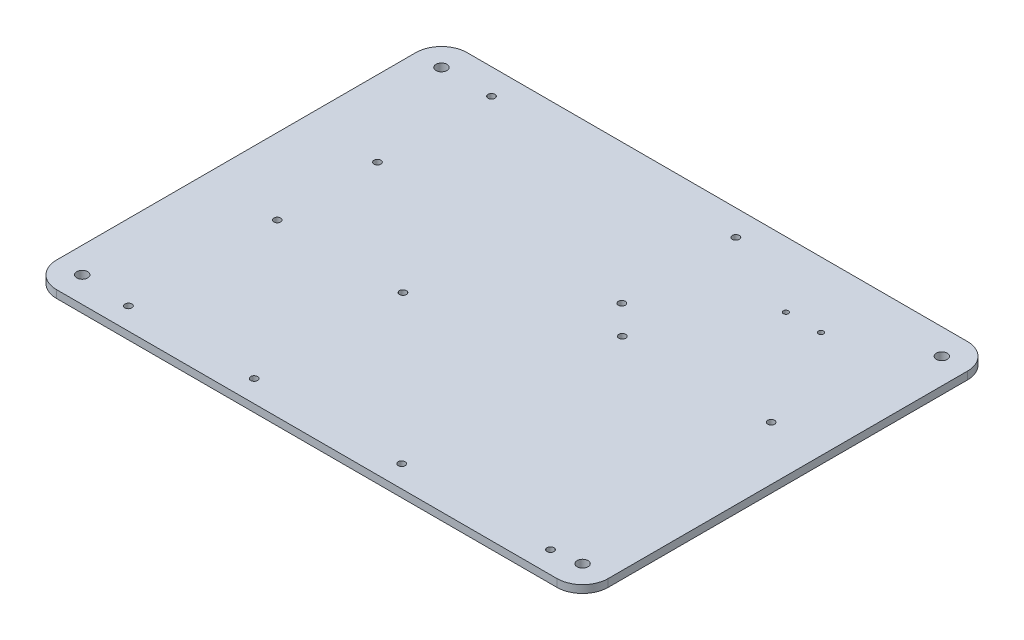
ISO-10303-21;
HEADER;
FILE_DESCRIPTION(('STEP AP214'),'2;1');
FILE_NAME('part.step','',(''),(''),'','','');
FILE_SCHEMA(('AUTOMOTIVE_DESIGN { 1 0 10303 214 1 1 1 1 }'));
ENDSEC;
DATA;
#1=APPLICATION_CONTEXT('core data for automotive mechanical design processes');
#2=APPLICATION_PROTOCOL_DEFINITION('international standard','automotive_design',2000,#1);
#3=PRODUCT_CONTEXT('',#1,'mechanical');
#4=PRODUCT('Part','Part','',(#3));
#5=PRODUCT_RELATED_PRODUCT_CATEGORY('part','',(#4));
#6=PRODUCT_DEFINITION_FORMATION('','',#4);
#7=PRODUCT_DEFINITION_CONTEXT('part definition',#1,'design');
#8=PRODUCT_DEFINITION('design','',#6,#7);
#9=PRODUCT_DEFINITION_SHAPE('','',#8);
#10=(LENGTH_UNIT() NAMED_UNIT(*) SI_UNIT(.MILLI.,.METRE.));
#11=(NAMED_UNIT(*) PLANE_ANGLE_UNIT() SI_UNIT($,.RADIAN.));
#12=(NAMED_UNIT(*) SI_UNIT($,.STERADIAN.) SOLID_ANGLE_UNIT());
#13=UNCERTAINTY_MEASURE_WITH_UNIT(LENGTH_MEASURE(1.E-05),#10,'distance_accuracy_value','');
#14=(GEOMETRIC_REPRESENTATION_CONTEXT(3) GLOBAL_UNCERTAINTY_ASSIGNED_CONTEXT((#13)) GLOBAL_UNIT_ASSIGNED_CONTEXT((#10,
#11,#12)) REPRESENTATION_CONTEXT('',''));
#15=CARTESIAN_POINT('',(0.,0.,0.));
#16=DIRECTION('',(0.,0.,1.));
#17=DIRECTION('',(1.,0.,0.));
#18=AXIS2_PLACEMENT_3D('',#15,#16,#17);
#19=CARTESIAN_POINT('',(-107.5,213.,-80.));
#20=DIRECTION('',(1.,0.,0.));
#21=DIRECTION('',(0.,1.,0.));
#22=AXIS2_PLACEMENT_3D('',#19,#20,#21);
#23=PLANE('',#22);
#24=DIRECTION('',(0.,0.,1.));
#25=VECTOR('',#24,1.);
#26=CARTESIAN_POINT('',(-107.5,210.,-80.));
#27=LINE('',#26,#25);
#28=CARTESIAN_POINT('',(-107.5,210.,-70.));
#29=VERTEX_POINT('',#28);
#30=CARTESIAN_POINT('',(-107.5,210.,70.));
#31=VERTEX_POINT('',#30);
#32=EDGE_CURVE('E130',#29,#31,#27,.T.);
#33=ORIENTED_EDGE('',*,*,#32,.T.);
#34=DIRECTION('',(0.,-1.,0.));
#35=VECTOR('',#34,1.);
#36=CARTESIAN_POINT('',(-107.5,213.,70.));
#37=LINE('',#36,#35);
#38=CARTESIAN_POINT('',(-107.5,213.,70.));
#39=VERTEX_POINT('',#38);
#40=EDGE_CURVE('E108',#31,#39,#37,.F.);
#41=ORIENTED_EDGE('',*,*,#40,.T.);
#42=DIRECTION('',(0.,0.,1.));
#43=VECTOR('',#42,1.);
#44=CARTESIAN_POINT('',(-107.5,213.,-80.));
#45=LINE('',#44,#43);
#46=CARTESIAN_POINT('',(-107.5,213.,-70.));
#47=VERTEX_POINT('',#46);
#48=EDGE_CURVE('E140',#47,#39,#45,.T.);
#49=ORIENTED_EDGE('',*,*,#48,.F.);
#50=DIRECTION('',(0.,-1.,0.));
#51=VECTOR('',#50,1.);
#52=CARTESIAN_POINT('',(-107.5,213.,-70.));
#53=LINE('',#52,#51);
#54=EDGE_CURVE('E113',#47,#29,#53,.T.);
#55=ORIENTED_EDGE('',*,*,#54,.T.);
#56=EDGE_LOOP('',(#33,#41,#49,#55));
#57=FACE_BOUND('',#56,.T.);
#58=ADVANCED_FACE('F37',(#57),#23,.F.);
#59=CARTESIAN_POINT('',(-107.5,213.,80.));
#60=DIRECTION('',(0.,0.,-1.));
#61=DIRECTION('',(0.,1.,0.));
#62=AXIS2_PLACEMENT_3D('',#59,#60,#61);
#63=PLANE('',#62);
#64=DIRECTION('',(1.,0.,0.));
#65=VECTOR('',#64,1.);
#66=CARTESIAN_POINT('',(-107.5,213.,80.));
#67=LINE('',#66,#65);
#68=CARTESIAN_POINT('',(-97.5,213.,80.));
#69=VERTEX_POINT('',#68);
#70=CARTESIAN_POINT('',(97.5,212.999999999998,80.));
#71=VERTEX_POINT('',#70);
#72=EDGE_CURVE('E123',#69,#71,#67,.T.);
#73=ORIENTED_EDGE('',*,*,#72,.F.);
#74=DIRECTION('',(0.,-1.,0.));
#75=VECTOR('',#74,1.);
#76=CARTESIAN_POINT('',(-97.5,213.,80.));
#77=LINE('',#76,#75);
#78=CARTESIAN_POINT('',(-97.5,210.,80.));
#79=VERTEX_POINT('',#78);
#80=EDGE_CURVE('E107',#69,#79,#77,.T.);
#81=ORIENTED_EDGE('',*,*,#80,.T.);
#82=DIRECTION('',(1.,0.,0.));
#83=VECTOR('',#82,1.);
#84=CARTESIAN_POINT('',(-107.5,210.,80.));
#85=LINE('',#84,#83);
#86=CARTESIAN_POINT('',(97.5,209.999999999998,80.));
#87=VERTEX_POINT('',#86);
#88=EDGE_CURVE('E120',#79,#87,#85,.T.);
#89=ORIENTED_EDGE('',*,*,#88,.T.);
#90=DIRECTION('',(0.,-1.,0.));
#91=VECTOR('',#90,1.);
#92=CARTESIAN_POINT('',(97.5,212.999999999998,80.));
#93=LINE('',#92,#91);
#94=EDGE_CURVE('E125',#87,#71,#93,.F.);
#95=ORIENTED_EDGE('',*,*,#94,.T.);
#96=EDGE_LOOP('',(#73,#81,#89,#95));
#97=FACE_BOUND('',#96,.T.);
#98=ADVANCED_FACE('F119',(#97),#63,.F.);
#99=CARTESIAN_POINT('',(107.5,212.999999999998,-80.));
#100=DIRECTION('',(-1.,0.,0.));
#101=DIRECTION('',(0.,-1.,0.));
#102=AXIS2_PLACEMENT_3D('',#99,#100,#101);
#103=PLANE('',#102);
#104=DIRECTION('',(0.,0.,-1.));
#105=VECTOR('',#104,1.);
#106=CARTESIAN_POINT('',(107.5,212.999999999998,-80.));
#107=LINE('',#106,#105);
#108=CARTESIAN_POINT('',(107.5,212.999999999998,70.));
#109=VERTEX_POINT('',#108);
#110=CARTESIAN_POINT('',(107.5,212.999999999998,-70.));
#111=VERTEX_POINT('',#110);
#112=EDGE_CURVE('E166',#109,#111,#107,.T.);
#113=ORIENTED_EDGE('',*,*,#112,.F.);
#114=DIRECTION('',(0.,-1.,0.));
#115=VECTOR('',#114,1.);
#116=CARTESIAN_POINT('',(107.5,212.999999999998,70.));
#117=LINE('',#116,#115);
#118=CARTESIAN_POINT('',(107.5,209.999999999998,70.));
#119=VERTEX_POINT('',#118);
#120=EDGE_CURVE('E159',#109,#119,#117,.T.);
#121=ORIENTED_EDGE('',*,*,#120,.T.);
#122=DIRECTION('',(0.,0.,-1.));
#123=VECTOR('',#122,1.);
#124=CARTESIAN_POINT('',(107.5,209.999999999998,-80.));
#125=LINE('',#124,#123);
#126=CARTESIAN_POINT('',(107.5,209.999999999998,-70.));
#127=VERTEX_POINT('',#126);
#128=EDGE_CURVE('E129',#119,#127,#125,.T.);
#129=ORIENTED_EDGE('',*,*,#128,.T.);
#130=DIRECTION('',(0.,-1.,0.));
#131=VECTOR('',#130,1.);
#132=CARTESIAN_POINT('',(107.5,212.999999999998,-70.));
#133=LINE('',#132,#131);
#134=EDGE_CURVE('E157',#127,#111,#133,.F.);
#135=ORIENTED_EDGE('',*,*,#134,.T.);
#136=EDGE_LOOP('',(#113,#121,#129,#135));
#137=FACE_BOUND('',#136,.T.);
#138=ADVANCED_FACE('F164',(#137),#103,.F.);
#139=CARTESIAN_POINT('',(-107.5,213.,-80.));
#140=DIRECTION('',(0.,0.,1.));
#141=DIRECTION('',(0.,-1.,0.));
#142=AXIS2_PLACEMENT_3D('',#139,#140,#141);
#143=PLANE('',#142);
#144=DIRECTION('',(-1.,0.,0.));
#145=VECTOR('',#144,1.);
#146=CARTESIAN_POINT('',(-107.5,213.,-80.));
#147=LINE('',#146,#145);
#148=CARTESIAN_POINT('',(97.5,212.999999999998,-80.));
#149=VERTEX_POINT('',#148);
#150=CARTESIAN_POINT('',(-97.5,213.,-80.));
#151=VERTEX_POINT('',#150);
#152=EDGE_CURVE('E141',#149,#151,#147,.T.);
#153=ORIENTED_EDGE('',*,*,#152,.F.);
#154=DIRECTION('',(0.,-1.,0.));
#155=VECTOR('',#154,1.);
#156=CARTESIAN_POINT('',(97.5,212.999999999998,-80.));
#157=LINE('',#156,#155);
#158=CARTESIAN_POINT('',(97.5,209.999999999998,-80.));
#159=VERTEX_POINT('',#158);
#160=EDGE_CURVE('E11',#149,#159,#157,.T.);
#161=ORIENTED_EDGE('',*,*,#160,.T.);
#162=DIRECTION('',(-1.,0.,0.));
#163=VECTOR('',#162,1.);
#164=CARTESIAN_POINT('',(-107.5,210.,-80.));
#165=LINE('',#164,#163);
#166=CARTESIAN_POINT('',(-97.5,210.,-80.));
#167=VERTEX_POINT('',#166);
#168=EDGE_CURVE('E133',#159,#167,#165,.T.);
#169=ORIENTED_EDGE('',*,*,#168,.T.);
#170=DIRECTION('',(0.,-1.,0.));
#171=VECTOR('',#170,1.);
#172=CARTESIAN_POINT('',(-97.5,213.,-80.));
#173=LINE('',#172,#171);
#174=EDGE_CURVE('E45',#167,#151,#173,.F.);
#175=ORIENTED_EDGE('',*,*,#174,.T.);
#176=EDGE_LOOP('',(#153,#161,#169,#175));
#177=FACE_BOUND('',#176,.T.);
#178=ADVANCED_FACE('F173',(#177),#143,.F.);
#179=CARTESIAN_POINT('',(2.19985138049827E-12,212.999999999999,0.));
#180=DIRECTION('',(0.,1.,0.));
#181=DIRECTION('',(-1.,0.,0.));
#182=AXIS2_PLACEMENT_3D('',#179,#180,#181);
#183=PLANE('',#182);
#184=CARTESIAN_POINT('',(-78.,213.,-25.55));
#185=DIRECTION('',(0.,1.,0.));
#186=DIRECTION('',(-1.,0.,0.));
#187=AXIS2_PLACEMENT_3D('',#184,#185,#186);
#188=CIRCLE('',#187,1.35000000000001);
#189=CARTESIAN_POINT('',(-79.35,213.,-25.55));
#190=VERTEX_POINT('',#189);
#191=EDGE_CURVE('E253',#190,#190,#188,.T.);
#192=ORIENTED_EDGE('',*,*,#191,.F.);
#193=EDGE_LOOP('',(#192));
#194=FACE_BOUND('',#193,.T.);
#195=CARTESIAN_POINT('',(17.25,212.999999999999,-25.55));
#196=DIRECTION('',(0.,1.,0.));
#197=DIRECTION('',(-1.,0.,0.));
#198=AXIS2_PLACEMENT_3D('',#195,#196,#197);
#199=CIRCLE('',#198,1.35);
#200=CARTESIAN_POINT('',(15.9,212.999999999999,-25.55));
#201=VERTEX_POINT('',#200);
#202=EDGE_CURVE('E247',#201,#201,#199,.T.);
#203=ORIENTED_EDGE('',*,*,#202,.F.);
#204=EDGE_LOOP('',(#203));
#205=FACE_BOUND('',#204,.T.);
#206=CARTESIAN_POINT('',(17.25,212.999999999999,-70.));
#207=DIRECTION('',(0.,1.,0.));
#208=DIRECTION('',(-1.,0.,0.));
#209=AXIS2_PLACEMENT_3D('',#206,#207,#208);
#210=CIRCLE('',#209,1.34999999999997);
#211=CARTESIAN_POINT('',(15.9,212.999999999999,-70.));
#212=VERTEX_POINT('',#211);
#213=EDGE_CURVE('E241',#212,#212,#210,.T.);
#214=ORIENTED_EDGE('',*,*,#213,.F.);
#215=EDGE_LOOP('',(#214));
#216=FACE_BOUND('',#215,.T.);
#217=CARTESIAN_POINT('',(52.25,212.999999999998,-54.5));
#218=DIRECTION('',(0.,1.,0.));
#219=DIRECTION('',(-1.,0.,0.));
#220=AXIS2_PLACEMENT_3D('',#217,#218,#219);
#221=CIRCLE('',#220,0.999999999999998);
#222=CARTESIAN_POINT('',(51.25,212.999999999998,-54.5));
#223=VERTEX_POINT('',#222);
#224=EDGE_CURVE('E234',#223,#223,#221,.T.);
#225=ORIENTED_EDGE('',*,*,#224,.F.);
#226=EDGE_LOOP('',(#225));
#227=FACE_BOUND('',#226,.T.);
#228=CARTESIAN_POINT('',(65.95,212.999999999998,-54.5));
#229=DIRECTION('',(0.,1.,0.));
#230=DIRECTION('',(-1.,0.,0.));
#231=AXIS2_PLACEMENT_3D('',#228,#229,#230);
#232=CIRCLE('',#231,0.999999999999998);
#233=CARTESIAN_POINT('',(64.95,212.999999999998,-54.5));
#234=VERTEX_POINT('',#233);
#235=EDGE_CURVE('E277',#234,#234,#232,.T.);
#236=ORIENTED_EDGE('',*,*,#235,.F.);
#237=EDGE_LOOP('',(#236));
#238=FACE_BOUND('',#237,.T.);
#239=CARTESIAN_POINT('',(97.5000000000001,212.999999999998,70.));
#240=DIRECTION('',(0.,1.,0.));
#241=DIRECTION('',(-1.,0.,0.));
#242=AXIS2_PLACEMENT_3D('',#239,#240,#241);
#243=CIRCLE('',#242,2.125);
#244=CARTESIAN_POINT('',(95.3750000000001,212.999999999998,70.));
#245=VERTEX_POINT('',#244);
#246=EDGE_CURVE('E271',#245,#245,#243,.T.);
#247=ORIENTED_EDGE('',*,*,#246,.F.);
#248=EDGE_LOOP('',(#247));
#249=FACE_BOUND('',#248,.T.);
#250=CARTESIAN_POINT('',(97.5000000000001,212.999999999998,-70.));
#251=DIRECTION('',(0.,1.,0.));
#252=DIRECTION('',(-1.,0.,0.));
#253=AXIS2_PLACEMENT_3D('',#250,#251,#252);
#254=CIRCLE('',#253,2.125);
#255=CARTESIAN_POINT('',(95.3750000000001,212.999999999998,-70.));
#256=VERTEX_POINT('',#255);
#257=EDGE_CURVE('E265',#256,#256,#254,.T.);
#258=ORIENTED_EDGE('',*,*,#257,.F.);
#259=EDGE_LOOP('',(#258));
#260=FACE_BOUND('',#259,.T.);
#261=CARTESIAN_POINT('',(-97.5,213.,-70.));
#262=DIRECTION('',(0.,1.,0.));
#263=DIRECTION('',(-1.,0.,0.));
#264=AXIS2_PLACEMENT_3D('',#261,#262,#263);
#265=CIRCLE('',#264,2.125);
#266=CARTESIAN_POINT('',(-99.625,213.,-70.));
#267=VERTEX_POINT('',#266);
#268=EDGE_CURVE('E258',#267,#267,#265,.T.);
#269=ORIENTED_EDGE('',*,*,#268,.F.);
#270=EDGE_LOOP('',(#269));
#271=FACE_BOUND('',#270,.T.);
#272=CARTESIAN_POINT('',(-78.,213.,13.5));
#273=DIRECTION('',(0.,1.,0.));
#274=DIRECTION('',(-1.,0.,0.));
#275=AXIS2_PLACEMENT_3D('',#272,#273,#274);
#276=CIRCLE('',#275,1.35000000000001);
#277=CARTESIAN_POINT('',(-79.35,213.,13.5));
#278=VERTEX_POINT('',#277);
#279=EDGE_CURVE('E205',#278,#278,#276,.T.);
#280=ORIENTED_EDGE('',*,*,#279,.F.);
#281=EDGE_LOOP('',(#280));
#282=FACE_BOUND('',#281,.T.);
#283=CARTESIAN_POINT('',(-29.,212.999999999999,13.5));
#284=DIRECTION('',(0.,1.,0.));
#285=DIRECTION('',(-1.,0.,0.));
#286=AXIS2_PLACEMENT_3D('',#283,#284,#285);
#287=CIRCLE('',#286,1.35);
#288=CARTESIAN_POINT('',(-30.35,212.999999999999,13.5));
#289=VERTEX_POINT('',#288);
#290=EDGE_CURVE('E199',#289,#289,#287,.T.);
#291=ORIENTED_EDGE('',*,*,#290,.F.);
#292=EDGE_LOOP('',(#291));
#293=FACE_BOUND('',#292,.T.);
#294=CARTESIAN_POINT('',(-29.,212.999999999999,71.5));
#295=DIRECTION('',(0.,1.,0.));
#296=DIRECTION('',(-1.,0.,0.));
#297=AXIS2_PLACEMENT_3D('',#294,#295,#296);
#298=CIRCLE('',#297,1.35);
#299=CARTESIAN_POINT('',(-30.35,212.999999999999,71.5));
#300=VERTEX_POINT('',#299);
#301=EDGE_CURVE('E193',#300,#300,#298,.T.);
#302=ORIENTED_EDGE('',*,*,#301,.F.);
#303=EDGE_LOOP('',(#302));
#304=FACE_BOUND('',#303,.T.);
#305=CARTESIAN_POINT('',(-78.,213.,71.5));
#306=DIRECTION('',(0.,1.,0.));
#307=DIRECTION('',(-1.,0.,0.));
#308=AXIS2_PLACEMENT_3D('',#305,#306,#307);
#309=CIRCLE('',#308,1.35000000000001);
#310=CARTESIAN_POINT('',(-79.35,213.,71.5));
#311=VERTEX_POINT('',#310);
#312=EDGE_CURVE('E186',#311,#311,#309,.T.);
#313=ORIENTED_EDGE('',*,*,#312,.F.);
#314=EDGE_LOOP('',(#313));
#315=FACE_BOUND('',#314,.T.);
#316=CARTESIAN_POINT('',(-78.,213.,-70.));
#317=DIRECTION('',(0.,1.,0.));
#318=DIRECTION('',(-1.,0.,0.));
#319=AXIS2_PLACEMENT_3D('',#316,#317,#318);
#320=CIRCLE('',#319,1.35000000000001);
#321=CARTESIAN_POINT('',(-79.35,213.,-70.));
#322=VERTEX_POINT('',#321);
#323=EDGE_CURVE('E222',#322,#322,#320,.T.);
#324=ORIENTED_EDGE('',*,*,#323,.F.);
#325=EDGE_LOOP('',(#324));
#326=FACE_BOUND('',#325,.T.);
#327=CARTESIAN_POINT('',(28.5,212.999999999999,-14.5));
#328=DIRECTION('',(0.,1.,0.));
#329=DIRECTION('',(-1.,0.,0.));
#330=AXIS2_PLACEMENT_3D('',#327,#328,#329);
#331=CIRCLE('',#330,1.35);
#332=CARTESIAN_POINT('',(27.15,212.999999999999,-14.5));
#333=VERTEX_POINT('',#332);
#334=EDGE_CURVE('E229',#333,#333,#331,.T.);
#335=ORIENTED_EDGE('',*,*,#334,.F.);
#336=EDGE_LOOP('',(#335));
#337=FACE_BOUND('',#336,.T.);
#338=CARTESIAN_POINT('',(28.5,212.999999999999,71.5));
#339=DIRECTION('',(0.,1.,0.));
#340=DIRECTION('',(-1.,0.,0.));
#341=AXIS2_PLACEMENT_3D('',#338,#339,#340);
#342=CIRCLE('',#341,1.35);
#343=CARTESIAN_POINT('',(27.15,212.999999999999,71.5));
#344=VERTEX_POINT('',#343);
#345=EDGE_CURVE('E210',#344,#344,#342,.T.);
#346=ORIENTED_EDGE('',*,*,#345,.F.);
#347=EDGE_LOOP('',(#346));
#348=FACE_BOUND('',#347,.T.);
#349=CARTESIAN_POINT('',(86.5,212.999999999998,-14.5));
#350=DIRECTION('',(0.,1.,0.));
#351=DIRECTION('',(-1.,0.,0.));
#352=AXIS2_PLACEMENT_3D('',#349,#350,#351);
#353=CIRCLE('',#352,1.35000000000001);
#354=CARTESIAN_POINT('',(85.15,212.999999999998,-14.5));
#355=VERTEX_POINT('',#354);
#356=EDGE_CURVE('E217',#355,#355,#353,.T.);
#357=ORIENTED_EDGE('',*,*,#356,.F.);
#358=EDGE_LOOP('',(#357));
#359=FACE_BOUND('',#358,.T.);
#360=CARTESIAN_POINT('',(-97.5,213.,70.));
#361=DIRECTION('',(0.,1.,0.));
#362=DIRECTION('',(-1.,0.,0.));
#363=AXIS2_PLACEMENT_3D('',#360,#361,#362);
#364=CIRCLE('',#363,2.125);
#365=CARTESIAN_POINT('',(-99.625,213.,70.));
#366=VERTEX_POINT('',#365);
#367=EDGE_CURVE('E282',#366,#366,#364,.T.);
#368=ORIENTED_EDGE('',*,*,#367,.F.);
#369=EDGE_LOOP('',(#368));
#370=FACE_BOUND('',#369,.T.);
#371=CARTESIAN_POINT('',(86.5,212.999999999998,71.5));
#372=DIRECTION('',(0.,1.,0.));
#373=DIRECTION('',(-1.,0.,0.));
#374=AXIS2_PLACEMENT_3D('',#371,#372,#373);
#375=CIRCLE('',#374,1.35000000000001);
#376=CARTESIAN_POINT('',(85.15,212.999999999998,71.5));
#377=VERTEX_POINT('',#376);
#378=EDGE_CURVE('E180',#377,#377,#375,.T.);
#379=ORIENTED_EDGE('',*,*,#378,.F.);
#380=EDGE_LOOP('',(#379));
#381=FACE_BOUND('',#380,.T.);
#382=ORIENTED_EDGE('',*,*,#48,.T.);
#383=CARTESIAN_POINT('',(-97.5,213.,70.));
#384=DIRECTION('',(0.,1.,0.));
#385=DIRECTION('',(-1.,0.,0.));
#386=AXIS2_PLACEMENT_3D('',#383,#384,#385);
#387=CIRCLE('',#386,10.);
#388=EDGE_CURVE('E155',#39,#69,#387,.T.);
#389=ORIENTED_EDGE('',*,*,#388,.T.);
#390=ORIENTED_EDGE('',*,*,#72,.T.);
#391=CARTESIAN_POINT('',(97.5,212.999999999998,70.));
#392=DIRECTION('',(0.,1.,0.));
#393=DIRECTION('',(-1.,0.,0.));
#394=AXIS2_PLACEMENT_3D('',#391,#392,#393);
#395=CIRCLE('',#394,10.);
#396=EDGE_CURVE('E153',#71,#109,#395,.T.);
#397=ORIENTED_EDGE('',*,*,#396,.T.);
#398=ORIENTED_EDGE('',*,*,#112,.T.);
#399=CARTESIAN_POINT('',(97.5,212.999999999998,-70.));
#400=DIRECTION('',(0.,1.,0.));
#401=DIRECTION('',(-1.,0.,0.));
#402=AXIS2_PLACEMENT_3D('',#399,#400,#401);
#403=CIRCLE('',#402,10.);
#404=EDGE_CURVE('E58',#111,#149,#403,.T.);
#405=ORIENTED_EDGE('',*,*,#404,.T.);
#406=ORIENTED_EDGE('',*,*,#152,.T.);
#407=CARTESIAN_POINT('',(-97.5,213.,-70.));
#408=DIRECTION('',(0.,1.,0.));
#409=DIRECTION('',(-1.,0.,0.));
#410=AXIS2_PLACEMENT_3D('',#407,#408,#409);
#411=CIRCLE('',#410,10.);
#412=EDGE_CURVE('E150',#151,#47,#411,.T.);
#413=ORIENTED_EDGE('',*,*,#412,.T.);
#414=EDGE_LOOP('',(#382,#389,#390,#397,#398,#405,#406,#413));
#415=FACE_BOUND('',#414,.T.);
#416=ADVANCED_FACE('F298',(#194,#205,#216,#227,#238,#249,#260,#271,#282,#293,#304,#315,#326,
#337,#348,#359,#370,#381,#415),#183,.T.);
#417=CARTESIAN_POINT('',(2.16880776903518E-12,209.999999999999,0.));
#418=DIRECTION('',(0.,1.,0.));
#419=DIRECTION('',(-1.,0.,0.));
#420=AXIS2_PLACEMENT_3D('',#417,#418,#419);
#421=PLANE('',#420);
#422=CARTESIAN_POINT('',(-78.,209.999999999997,-25.55));
#423=DIRECTION('',(0.,1.,0.));
#424=DIRECTION('',(-1.,0.,0.));
#425=AXIS2_PLACEMENT_3D('',#422,#423,#424);
#426=CIRCLE('',#425,1.35000000000001);
#427=CARTESIAN_POINT('',(-79.3500000000001,209.999999999997,-25.55));
#428=VERTEX_POINT('',#427);
#429=EDGE_CURVE('E226',#428,#428,#426,.T.);
#430=ORIENTED_EDGE('',*,*,#429,.T.);
#431=EDGE_LOOP('',(#430));
#432=FACE_BOUND('',#431,.T.);
#433=CARTESIAN_POINT('',(17.25,209.999999999997,-25.55));
#434=DIRECTION('',(0.,1.,0.));
#435=DIRECTION('',(-1.,0.,0.));
#436=AXIS2_PLACEMENT_3D('',#433,#434,#435);
#437=CIRCLE('',#436,1.35);
#438=CARTESIAN_POINT('',(15.9,209.999999999997,-25.55));
#439=VERTEX_POINT('',#438);
#440=EDGE_CURVE('E250',#439,#439,#437,.T.);
#441=ORIENTED_EDGE('',*,*,#440,.T.);
#442=EDGE_LOOP('',(#441));
#443=FACE_BOUND('',#442,.T.);
#444=CARTESIAN_POINT('',(17.25,209.999999999997,-70.));
#445=DIRECTION('',(0.,1.,0.));
#446=DIRECTION('',(-1.,0.,0.));
#447=AXIS2_PLACEMENT_3D('',#444,#445,#446);
#448=CIRCLE('',#447,1.34999999999997);
#449=CARTESIAN_POINT('',(15.9,209.999999999997,-70.));
#450=VERTEX_POINT('',#449);
#451=EDGE_CURVE('E244',#450,#450,#448,.T.);
#452=ORIENTED_EDGE('',*,*,#451,.T.);
#453=EDGE_LOOP('',(#452));
#454=FACE_BOUND('',#453,.T.);
#455=CARTESIAN_POINT('',(52.25,209.999999999996,-54.5));
#456=DIRECTION('',(0.,1.,0.));
#457=DIRECTION('',(-1.,0.,0.));
#458=AXIS2_PLACEMENT_3D('',#455,#456,#457);
#459=CIRCLE('',#458,0.999999999999998);
#460=CARTESIAN_POINT('',(51.25,209.999999999996,-54.5));
#461=VERTEX_POINT('',#460);
#462=EDGE_CURVE('E237',#461,#461,#459,.T.);
#463=ORIENTED_EDGE('',*,*,#462,.T.);
#464=EDGE_LOOP('',(#463));
#465=FACE_BOUND('',#464,.T.);
#466=CARTESIAN_POINT('',(65.95,209.999999999996,-54.5));
#467=DIRECTION('',(0.,1.,0.));
#468=DIRECTION('',(-1.,0.,0.));
#469=AXIS2_PLACEMENT_3D('',#466,#467,#468);
#470=CIRCLE('',#469,0.999999999999998);
#471=CARTESIAN_POINT('',(64.95,209.999999999996,-54.5));
#472=VERTEX_POINT('',#471);
#473=EDGE_CURVE('E238',#472,#472,#470,.T.);
#474=ORIENTED_EDGE('',*,*,#473,.T.);
#475=EDGE_LOOP('',(#474));
#476=FACE_BOUND('',#475,.T.);
#477=CARTESIAN_POINT('',(97.5,209.999999999996,70.));
#478=DIRECTION('',(0.,1.,0.));
#479=DIRECTION('',(-1.,0.,0.));
#480=AXIS2_PLACEMENT_3D('',#477,#478,#479);
#481=CIRCLE('',#480,2.125);
#482=CARTESIAN_POINT('',(95.375,209.999999999996,70.));
#483=VERTEX_POINT('',#482);
#484=EDGE_CURVE('E274',#483,#483,#481,.T.);
#485=ORIENTED_EDGE('',*,*,#484,.T.);
#486=EDGE_LOOP('',(#485));
#487=FACE_BOUND('',#486,.T.);
#488=CARTESIAN_POINT('',(97.5,209.999999999996,-70.));
#489=DIRECTION('',(0.,1.,0.));
#490=DIRECTION('',(-1.,0.,0.));
#491=AXIS2_PLACEMENT_3D('',#488,#489,#490);
#492=CIRCLE('',#491,2.125);
#493=CARTESIAN_POINT('',(95.375,209.999999999996,-70.));
#494=VERTEX_POINT('',#493);
#495=EDGE_CURVE('E268',#494,#494,#492,.T.);
#496=ORIENTED_EDGE('',*,*,#495,.T.);
#497=EDGE_LOOP('',(#496));
#498=FACE_BOUND('',#497,.T.);
#499=CARTESIAN_POINT('',(-97.5,209.999999999998,-70.));
#500=DIRECTION('',(0.,1.,0.));
#501=DIRECTION('',(-1.,0.,0.));
#502=AXIS2_PLACEMENT_3D('',#499,#500,#501);
#503=CIRCLE('',#502,2.125);
#504=CARTESIAN_POINT('',(-99.625,209.999999999998,-70.));
#505=VERTEX_POINT('',#504);
#506=EDGE_CURVE('E261',#505,#505,#503,.T.);
#507=ORIENTED_EDGE('',*,*,#506,.T.);
#508=EDGE_LOOP('',(#507));
#509=FACE_BOUND('',#508,.T.);
#510=CARTESIAN_POINT('',(-78.,209.999999999997,13.5));
#511=DIRECTION('',(0.,1.,0.));
#512=DIRECTION('',(-1.,0.,0.));
#513=AXIS2_PLACEMENT_3D('',#510,#511,#512);
#514=CIRCLE('',#513,1.35000000000001);
#515=CARTESIAN_POINT('',(-79.35,209.999999999997,13.5));
#516=VERTEX_POINT('',#515);
#517=EDGE_CURVE('E183',#516,#516,#514,.T.);
#518=ORIENTED_EDGE('',*,*,#517,.T.);
#519=EDGE_LOOP('',(#518));
#520=FACE_BOUND('',#519,.T.);
#521=CARTESIAN_POINT('',(-29.,209.999999999997,13.5));
#522=DIRECTION('',(0.,1.,0.));
#523=DIRECTION('',(-1.,0.,0.));
#524=AXIS2_PLACEMENT_3D('',#521,#522,#523);
#525=CIRCLE('',#524,1.35);
#526=CARTESIAN_POINT('',(-30.35,209.999999999997,13.5));
#527=VERTEX_POINT('',#526);
#528=EDGE_CURVE('E202',#527,#527,#525,.T.);
#529=ORIENTED_EDGE('',*,*,#528,.T.);
#530=EDGE_LOOP('',(#529));
#531=FACE_BOUND('',#530,.T.);
#532=CARTESIAN_POINT('',(-29.,209.999999999997,71.5));
#533=DIRECTION('',(0.,1.,0.));
#534=DIRECTION('',(-1.,0.,0.));
#535=AXIS2_PLACEMENT_3D('',#532,#533,#534);
#536=CIRCLE('',#535,1.35);
#537=CARTESIAN_POINT('',(-30.35,209.999999999997,71.5));
#538=VERTEX_POINT('',#537);
#539=EDGE_CURVE('E196',#538,#538,#536,.T.);
#540=ORIENTED_EDGE('',*,*,#539,.T.);
#541=EDGE_LOOP('',(#540));
#542=FACE_BOUND('',#541,.T.);
#543=CARTESIAN_POINT('',(-78.,209.999999999997,71.5));
#544=DIRECTION('',(0.,1.,0.));
#545=DIRECTION('',(-1.,0.,0.));
#546=AXIS2_PLACEMENT_3D('',#543,#544,#545);
#547=CIRCLE('',#546,1.35000000000001);
#548=CARTESIAN_POINT('',(-79.35,209.999999999997,71.5));
#549=VERTEX_POINT('',#548);
#550=EDGE_CURVE('E189',#549,#549,#547,.T.);
#551=ORIENTED_EDGE('',*,*,#550,.T.);
#552=EDGE_LOOP('',(#551));
#553=FACE_BOUND('',#552,.T.);
#554=CARTESIAN_POINT('',(-78.,209.999999999997,-70.));
#555=DIRECTION('',(0.,1.,0.));
#556=DIRECTION('',(-1.,0.,0.));
#557=AXIS2_PLACEMENT_3D('',#554,#555,#556);
#558=CIRCLE('',#557,1.35000000000001);
#559=CARTESIAN_POINT('',(-79.3500000000001,209.999999999997,-70.));
#560=VERTEX_POINT('',#559);
#561=EDGE_CURVE('E225',#560,#560,#558,.T.);
#562=ORIENTED_EDGE('',*,*,#561,.T.);
#563=EDGE_LOOP('',(#562));
#564=FACE_BOUND('',#563,.T.);
#565=CARTESIAN_POINT('',(28.5,209.999999999996,-14.5));
#566=DIRECTION('',(0.,1.,0.));
#567=DIRECTION('',(-1.,0.,0.));
#568=AXIS2_PLACEMENT_3D('',#565,#566,#567);
#569=CIRCLE('',#568,1.35);
#570=CARTESIAN_POINT('',(27.15,209.999999999996,-14.5));
#571=VERTEX_POINT('',#570);
#572=EDGE_CURVE('E214',#571,#571,#569,.T.);
#573=ORIENTED_EDGE('',*,*,#572,.T.);
#574=EDGE_LOOP('',(#573));
#575=FACE_BOUND('',#574,.T.);
#576=CARTESIAN_POINT('',(28.5,209.999999999996,71.5));
#577=DIRECTION('',(0.,1.,0.));
#578=DIRECTION('',(-1.,0.,0.));
#579=AXIS2_PLACEMENT_3D('',#576,#577,#578);
#580=CIRCLE('',#579,1.35);
#581=CARTESIAN_POINT('',(27.15,209.999999999996,71.5));
#582=VERTEX_POINT('',#581);
#583=EDGE_CURVE('E213',#582,#582,#580,.T.);
#584=ORIENTED_EDGE('',*,*,#583,.T.);
#585=EDGE_LOOP('',(#584));
#586=FACE_BOUND('',#585,.T.);
#587=CARTESIAN_POINT('',(86.5,209.999999999996,-14.5));
#588=DIRECTION('',(0.,1.,0.));
#589=DIRECTION('',(-1.,0.,0.));
#590=AXIS2_PLACEMENT_3D('',#587,#588,#589);
#591=CIRCLE('',#590,1.35000000000001);
#592=CARTESIAN_POINT('',(85.15,209.999999999996,-14.5));
#593=VERTEX_POINT('',#592);
#594=EDGE_CURVE('E190',#593,#593,#591,.T.);
#595=ORIENTED_EDGE('',*,*,#594,.T.);
#596=EDGE_LOOP('',(#595));
#597=FACE_BOUND('',#596,.T.);
#598=CARTESIAN_POINT('',(-97.5,209.999999999998,70.));
#599=DIRECTION('',(0.,1.,0.));
#600=DIRECTION('',(-1.,0.,0.));
#601=AXIS2_PLACEMENT_3D('',#598,#599,#600);
#602=CIRCLE('',#601,2.125);
#603=CARTESIAN_POINT('',(-99.625,209.999999999998,70.));
#604=VERTEX_POINT('',#603);
#605=EDGE_CURVE('E262',#604,#604,#602,.T.);
#606=ORIENTED_EDGE('',*,*,#605,.T.);
#607=EDGE_LOOP('',(#606));
#608=FACE_BOUND('',#607,.T.);
#609=CARTESIAN_POINT('',(86.5,209.999999999996,71.5));
#610=DIRECTION('',(0.,1.,0.));
#611=DIRECTION('',(-1.,0.,0.));
#612=AXIS2_PLACEMENT_3D('',#609,#610,#611);
#613=CIRCLE('',#612,1.35000000000001);
#614=CARTESIAN_POINT('',(85.15,209.999999999996,71.5));
#615=VERTEX_POINT('',#614);
#616=EDGE_CURVE('E135',#615,#615,#613,.T.);
#617=ORIENTED_EDGE('',*,*,#616,.T.);
#618=EDGE_LOOP('',(#617));
#619=FACE_BOUND('',#618,.T.);
#620=ORIENTED_EDGE('',*,*,#88,.F.);
#621=CARTESIAN_POINT('',(-97.5,210.,70.));
#622=DIRECTION('',(0.,1.,0.));
#623=DIRECTION('',(-1.,0.,0.));
#624=AXIS2_PLACEMENT_3D('',#621,#622,#623);
#625=CIRCLE('',#624,10.);
#626=EDGE_CURVE('E103',#79,#31,#625,.F.);
#627=ORIENTED_EDGE('',*,*,#626,.T.);
#628=ORIENTED_EDGE('',*,*,#32,.F.);
#629=CARTESIAN_POINT('',(-97.5,210.,-70.));
#630=DIRECTION('',(0.,1.,0.));
#631=DIRECTION('',(-1.,0.,0.));
#632=AXIS2_PLACEMENT_3D('',#629,#630,#631);
#633=CIRCLE('',#632,10.);
#634=EDGE_CURVE('E124',#29,#167,#633,.F.);
#635=ORIENTED_EDGE('',*,*,#634,.T.);
#636=ORIENTED_EDGE('',*,*,#168,.F.);
#637=CARTESIAN_POINT('',(97.5,209.999999999998,-70.));
#638=DIRECTION('',(0.,1.,0.));
#639=DIRECTION('',(-1.,0.,0.));
#640=AXIS2_PLACEMENT_3D('',#637,#638,#639);
#641=CIRCLE('',#640,10.);
#642=EDGE_CURVE('E144',#159,#127,#641,.F.);
#643=ORIENTED_EDGE('',*,*,#642,.T.);
#644=ORIENTED_EDGE('',*,*,#128,.F.);
#645=CARTESIAN_POINT('',(97.5,209.999999999998,70.));
#646=DIRECTION('',(0.,1.,0.));
#647=DIRECTION('',(-1.,0.,0.));
#648=AXIS2_PLACEMENT_3D('',#645,#646,#647);
#649=CIRCLE('',#648,10.);
#650=EDGE_CURVE('E114',#119,#87,#649,.F.);
#651=ORIENTED_EDGE('',*,*,#650,.T.);
#652=EDGE_LOOP('',(#620,#627,#628,#635,#636,#643,#644,#651));
#653=FACE_BOUND('',#652,.T.);
#654=ADVANCED_FACE('F127',(#432,#443,#454,#465,#476,#487,#498,#509,#520,#531,#542,#553,#564,
#575,#586,#597,#608,#619,#653),#421,.F.);
#655=CARTESIAN_POINT('',(86.5,209.999999999996,71.5));
#656=DIRECTION('',(0.,1.,0.));
#657=DIRECTION('',(-1.,0.,0.));
#658=AXIS2_PLACEMENT_3D('',#655,#656,#657);
#659=CYLINDRICAL_SURFACE('',#658,1.35000000000001);
#660=ORIENTED_EDGE('',*,*,#616,.F.);
#661=EDGE_LOOP('',(#660));
#662=FACE_BOUND('',#661,.T.);
#663=ORIENTED_EDGE('',*,*,#378,.T.);
#664=EDGE_LOOP('',(#663));
#665=FACE_BOUND('',#664,.T.);
#666=ADVANCED_FACE('F294',(#662,#665),#659,.F.);
#667=CARTESIAN_POINT('',(-97.5,209.999999999998,70.));
#668=DIRECTION('',(0.,1.,0.));
#669=DIRECTION('',(-1.,0.,0.));
#670=AXIS2_PLACEMENT_3D('',#667,#668,#669);
#671=CYLINDRICAL_SURFACE('',#670,2.125);
#672=ORIENTED_EDGE('',*,*,#605,.F.);
#673=EDGE_LOOP('',(#672));
#674=FACE_BOUND('',#673,.T.);
#675=ORIENTED_EDGE('',*,*,#367,.T.);
#676=EDGE_LOOP('',(#675));
#677=FACE_BOUND('',#676,.T.);
#678=ADVANCED_FACE('F290',(#674,#677),#671,.F.);
#679=CARTESIAN_POINT('',(86.5,209.999999999996,-14.5));
#680=DIRECTION('',(0.,1.,0.));
#681=DIRECTION('',(-1.,0.,0.));
#682=AXIS2_PLACEMENT_3D('',#679,#680,#681);
#683=CYLINDRICAL_SURFACE('',#682,1.35000000000001);
#684=ORIENTED_EDGE('',*,*,#594,.F.);
#685=EDGE_LOOP('',(#684));
#686=FACE_BOUND('',#685,.T.);
#687=ORIENTED_EDGE('',*,*,#356,.T.);
#688=EDGE_LOOP('',(#687));
#689=FACE_BOUND('',#688,.T.);
#690=ADVANCED_FACE('F293',(#686,#689),#683,.F.);
#691=CARTESIAN_POINT('',(28.5,209.999999999996,71.5));
#692=DIRECTION('',(0.,1.,0.));
#693=DIRECTION('',(-1.,0.,0.));
#694=AXIS2_PLACEMENT_3D('',#691,#692,#693);
#695=CYLINDRICAL_SURFACE('',#694,1.35);
#696=ORIENTED_EDGE('',*,*,#583,.F.);
#697=EDGE_LOOP('',(#696));
#698=FACE_BOUND('',#697,.T.);
#699=ORIENTED_EDGE('',*,*,#345,.T.);
#700=EDGE_LOOP('',(#699));
#701=FACE_BOUND('',#700,.T.);
#702=ADVANCED_FACE('F489',(#698,#701),#695,.F.);
#703=CARTESIAN_POINT('',(28.5,209.999999999996,-14.5));
#704=DIRECTION('',(0.,1.,0.));
#705=DIRECTION('',(-1.,0.,0.));
#706=AXIS2_PLACEMENT_3D('',#703,#704,#705);
#707=CYLINDRICAL_SURFACE('',#706,1.35);
#708=ORIENTED_EDGE('',*,*,#572,.F.);
#709=EDGE_LOOP('',(#708));
#710=FACE_BOUND('',#709,.T.);
#711=ORIENTED_EDGE('',*,*,#334,.T.);
#712=EDGE_LOOP('',(#711));
#713=FACE_BOUND('',#712,.T.);
#714=ADVANCED_FACE('F479',(#710,#713),#707,.F.);
#715=CARTESIAN_POINT('',(-78.,209.999999999997,-70.));
#716=DIRECTION('',(0.,1.,0.));
#717=DIRECTION('',(-1.,0.,0.));
#718=AXIS2_PLACEMENT_3D('',#715,#716,#717);
#719=CYLINDRICAL_SURFACE('',#718,1.35000000000001);
#720=ORIENTED_EDGE('',*,*,#561,.F.);
#721=EDGE_LOOP('',(#720));
#722=FACE_BOUND('',#721,.T.);
#723=ORIENTED_EDGE('',*,*,#323,.T.);
#724=EDGE_LOOP('',(#723));
#725=FACE_BOUND('',#724,.T.);
#726=ADVANCED_FACE('F469',(#722,#725),#719,.F.);
#727=CARTESIAN_POINT('',(-78.,209.999999999997,71.5));
#728=DIRECTION('',(0.,1.,0.));
#729=DIRECTION('',(-1.,0.,0.));
#730=AXIS2_PLACEMENT_3D('',#727,#728,#729);
#731=CYLINDRICAL_SURFACE('',#730,1.35000000000001);
#732=ORIENTED_EDGE('',*,*,#550,.F.);
#733=EDGE_LOOP('',(#732));
#734=FACE_BOUND('',#733,.T.);
#735=ORIENTED_EDGE('',*,*,#312,.T.);
#736=EDGE_LOOP('',(#735));
#737=FACE_BOUND('',#736,.T.);
#738=ADVANCED_FACE('F459',(#734,#737),#731,.F.);
#739=CARTESIAN_POINT('',(-29.,209.999999999997,71.5));
#740=DIRECTION('',(0.,1.,0.));
#741=DIRECTION('',(-1.,0.,0.));
#742=AXIS2_PLACEMENT_3D('',#739,#740,#741);
#743=CYLINDRICAL_SURFACE('',#742,1.35);
#744=ORIENTED_EDGE('',*,*,#539,.F.);
#745=EDGE_LOOP('',(#744));
#746=FACE_BOUND('',#745,.T.);
#747=ORIENTED_EDGE('',*,*,#301,.T.);
#748=EDGE_LOOP('',(#747));
#749=FACE_BOUND('',#748,.T.);
#750=ADVANCED_FACE('F449',(#746,#749),#743,.F.);
#751=CARTESIAN_POINT('',(-29.,209.999999999997,13.5));
#752=DIRECTION('',(0.,1.,0.));
#753=DIRECTION('',(-1.,0.,0.));
#754=AXIS2_PLACEMENT_3D('',#751,#752,#753);
#755=CYLINDRICAL_SURFACE('',#754,1.35);
#756=ORIENTED_EDGE('',*,*,#528,.F.);
#757=EDGE_LOOP('',(#756));
#758=FACE_BOUND('',#757,.T.);
#759=ORIENTED_EDGE('',*,*,#290,.T.);
#760=EDGE_LOOP('',(#759));
#761=FACE_BOUND('',#760,.T.);
#762=ADVANCED_FACE('F439',(#758,#761),#755,.F.);
#763=CARTESIAN_POINT('',(-78.,209.999999999997,13.5));
#764=DIRECTION('',(0.,1.,0.));
#765=DIRECTION('',(-1.,0.,0.));
#766=AXIS2_PLACEMENT_3D('',#763,#764,#765);
#767=CYLINDRICAL_SURFACE('',#766,1.35000000000001);
#768=ORIENTED_EDGE('',*,*,#517,.F.);
#769=EDGE_LOOP('',(#768));
#770=FACE_BOUND('',#769,.T.);
#771=ORIENTED_EDGE('',*,*,#279,.T.);
#772=EDGE_LOOP('',(#771));
#773=FACE_BOUND('',#772,.T.);
#774=ADVANCED_FACE('F429',(#770,#773),#767,.F.);
#775=CARTESIAN_POINT('',(-97.5,209.999999999998,-70.));
#776=DIRECTION('',(0.,1.,0.));
#777=DIRECTION('',(-1.,0.,0.));
#778=AXIS2_PLACEMENT_3D('',#775,#776,#777);
#779=CYLINDRICAL_SURFACE('',#778,2.125);
#780=ORIENTED_EDGE('',*,*,#506,.F.);
#781=EDGE_LOOP('',(#780));
#782=FACE_BOUND('',#781,.T.);
#783=ORIENTED_EDGE('',*,*,#268,.T.);
#784=EDGE_LOOP('',(#783));
#785=FACE_BOUND('',#784,.T.);
#786=ADVANCED_FACE('F419',(#782,#785),#779,.F.);
#787=CARTESIAN_POINT('',(97.5,209.999999999996,-70.));
#788=DIRECTION('',(0.,1.,0.));
#789=DIRECTION('',(-1.,0.,0.));
#790=AXIS2_PLACEMENT_3D('',#787,#788,#789);
#791=CYLINDRICAL_SURFACE('',#790,2.125);
#792=ORIENTED_EDGE('',*,*,#495,.F.);
#793=EDGE_LOOP('',(#792));
#794=FACE_BOUND('',#793,.T.);
#795=ORIENTED_EDGE('',*,*,#257,.T.);
#796=EDGE_LOOP('',(#795));
#797=FACE_BOUND('',#796,.T.);
#798=ADVANCED_FACE('F409',(#794,#797),#791,.F.);
#799=CARTESIAN_POINT('',(97.5,209.999999999996,70.));
#800=DIRECTION('',(0.,1.,0.));
#801=DIRECTION('',(-1.,0.,0.));
#802=AXIS2_PLACEMENT_3D('',#799,#800,#801);
#803=CYLINDRICAL_SURFACE('',#802,2.125);
#804=ORIENTED_EDGE('',*,*,#484,.F.);
#805=EDGE_LOOP('',(#804));
#806=FACE_BOUND('',#805,.T.);
#807=ORIENTED_EDGE('',*,*,#246,.T.);
#808=EDGE_LOOP('',(#807));
#809=FACE_BOUND('',#808,.T.);
#810=ADVANCED_FACE('F399',(#806,#809),#803,.F.);
#811=CARTESIAN_POINT('',(65.95,209.999999999996,-54.5));
#812=DIRECTION('',(0.,1.,0.));
#813=DIRECTION('',(-1.,0.,0.));
#814=AXIS2_PLACEMENT_3D('',#811,#812,#813);
#815=CYLINDRICAL_SURFACE('',#814,0.999999999999998);
#816=ORIENTED_EDGE('',*,*,#473,.F.);
#817=EDGE_LOOP('',(#816));
#818=FACE_BOUND('',#817,.T.);
#819=ORIENTED_EDGE('',*,*,#235,.T.);
#820=EDGE_LOOP('',(#819));
#821=FACE_BOUND('',#820,.T.);
#822=ADVANCED_FACE('F389',(#818,#821),#815,.F.);
#823=CARTESIAN_POINT('',(52.25,209.999999999996,-54.5));
#824=DIRECTION('',(0.,1.,0.));
#825=DIRECTION('',(-1.,0.,0.));
#826=AXIS2_PLACEMENT_3D('',#823,#824,#825);
#827=CYLINDRICAL_SURFACE('',#826,0.999999999999998);
#828=ORIENTED_EDGE('',*,*,#462,.F.);
#829=EDGE_LOOP('',(#828));
#830=FACE_BOUND('',#829,.T.);
#831=ORIENTED_EDGE('',*,*,#224,.T.);
#832=EDGE_LOOP('',(#831));
#833=FACE_BOUND('',#832,.T.);
#834=ADVANCED_FACE('F379',(#830,#833),#827,.F.);
#835=CARTESIAN_POINT('',(17.25,209.999999999997,-70.));
#836=DIRECTION('',(0.,1.,0.));
#837=DIRECTION('',(-1.,0.,0.));
#838=AXIS2_PLACEMENT_3D('',#835,#836,#837);
#839=CYLINDRICAL_SURFACE('',#838,1.34999999999997);
#840=ORIENTED_EDGE('',*,*,#451,.F.);
#841=EDGE_LOOP('',(#840));
#842=FACE_BOUND('',#841,.T.);
#843=ORIENTED_EDGE('',*,*,#213,.T.);
#844=EDGE_LOOP('',(#843));
#845=FACE_BOUND('',#844,.T.);
#846=ADVANCED_FACE('F369',(#842,#845),#839,.F.);
#847=CARTESIAN_POINT('',(17.25,209.999999999997,-25.55));
#848=DIRECTION('',(0.,1.,0.));
#849=DIRECTION('',(-1.,0.,0.));
#850=AXIS2_PLACEMENT_3D('',#847,#848,#849);
#851=CYLINDRICAL_SURFACE('',#850,1.35);
#852=ORIENTED_EDGE('',*,*,#440,.F.);
#853=EDGE_LOOP('',(#852));
#854=FACE_BOUND('',#853,.T.);
#855=ORIENTED_EDGE('',*,*,#202,.T.);
#856=EDGE_LOOP('',(#855));
#857=FACE_BOUND('',#856,.T.);
#858=ADVANCED_FACE('F359',(#854,#857),#851,.F.);
#859=CARTESIAN_POINT('',(-78.,209.999999999997,-25.55));
#860=DIRECTION('',(0.,1.,0.));
#861=DIRECTION('',(-1.,0.,0.));
#862=AXIS2_PLACEMENT_3D('',#859,#860,#861);
#863=CYLINDRICAL_SURFACE('',#862,1.35000000000001);
#864=ORIENTED_EDGE('',*,*,#429,.F.);
#865=EDGE_LOOP('',(#864));
#866=FACE_BOUND('',#865,.T.);
#867=ORIENTED_EDGE('',*,*,#191,.T.);
#868=EDGE_LOOP('',(#867));
#869=FACE_BOUND('',#868,.T.);
#870=ADVANCED_FACE('F323',(#866,#869),#863,.F.);
#871=CARTESIAN_POINT('',(-97.5,213.,70.));
#872=DIRECTION('',(0.,-1.,0.));
#873=DIRECTION('',(1.,0.,0.));
#874=AXIS2_PLACEMENT_3D('',#871,#872,#873);
#875=CYLINDRICAL_SURFACE('',#874,10.);
#876=ORIENTED_EDGE('',*,*,#388,.F.);
#877=ORIENTED_EDGE('',*,*,#40,.F.);
#878=ORIENTED_EDGE('',*,*,#626,.F.);
#879=ORIENTED_EDGE('',*,*,#80,.F.);
#880=EDGE_LOOP('',(#876,#877,#878,#879));
#881=FACE_BOUND('',#880,.T.);
#882=ADVANCED_FACE('F106',(#881),#875,.T.);
#883=CARTESIAN_POINT('',(97.5,212.999999999998,70.));
#884=DIRECTION('',(0.,-1.,0.));
#885=DIRECTION('',(1.,0.,0.));
#886=AXIS2_PLACEMENT_3D('',#883,#884,#885);
#887=CYLINDRICAL_SURFACE('',#886,10.);
#888=ORIENTED_EDGE('',*,*,#396,.F.);
#889=ORIENTED_EDGE('',*,*,#94,.F.);
#890=ORIENTED_EDGE('',*,*,#650,.F.);
#891=ORIENTED_EDGE('',*,*,#120,.F.);
#892=EDGE_LOOP('',(#888,#889,#890,#891));
#893=FACE_BOUND('',#892,.T.);
#894=ADVANCED_FACE('F312',(#893),#887,.T.);
#895=CARTESIAN_POINT('',(97.5,212.999999999998,-70.));
#896=DIRECTION('',(0.,-1.,0.));
#897=DIRECTION('',(1.,0.,0.));
#898=AXIS2_PLACEMENT_3D('',#895,#896,#897);
#899=CYLINDRICAL_SURFACE('',#898,10.);
#900=ORIENTED_EDGE('',*,*,#404,.F.);
#901=ORIENTED_EDGE('',*,*,#134,.F.);
#902=ORIENTED_EDGE('',*,*,#642,.F.);
#903=ORIENTED_EDGE('',*,*,#160,.F.);
#904=EDGE_LOOP('',(#900,#901,#902,#903));
#905=FACE_BOUND('',#904,.T.);
#906=ADVANCED_FACE('F172',(#905),#899,.T.);
#907=CARTESIAN_POINT('',(-97.5,213.,-70.));
#908=DIRECTION('',(0.,-1.,0.));
#909=DIRECTION('',(1.,0.,0.));
#910=AXIS2_PLACEMENT_3D('',#907,#908,#909);
#911=CYLINDRICAL_SURFACE('',#910,10.);
#912=ORIENTED_EDGE('',*,*,#412,.F.);
#913=ORIENTED_EDGE('',*,*,#174,.F.);
#914=ORIENTED_EDGE('',*,*,#634,.F.);
#915=ORIENTED_EDGE('',*,*,#54,.F.);
#916=EDGE_LOOP('',(#912,#913,#914,#915));
#917=FACE_BOUND('',#916,.T.);
#918=ADVANCED_FACE('F39',(#917),#911,.T.);
#919=CLOSED_SHELL('',(#58,#98,#138,#178,#416,#654,#666,#678,#690,#702,#714,#726,#738,#750,#762,
#774,#786,#798,#810,#822,#834,#846,#858,#870,#882,#894,#906,#918));
#920=MANIFOLD_SOLID_BREP('B2',#919);
#921=ADVANCED_BREP_SHAPE_REPRESENTATION('',(#18,#920),#14);
#922=SHAPE_DEFINITION_REPRESENTATION(#9,#921);
ENDSEC;
END-ISO-10303-21;
